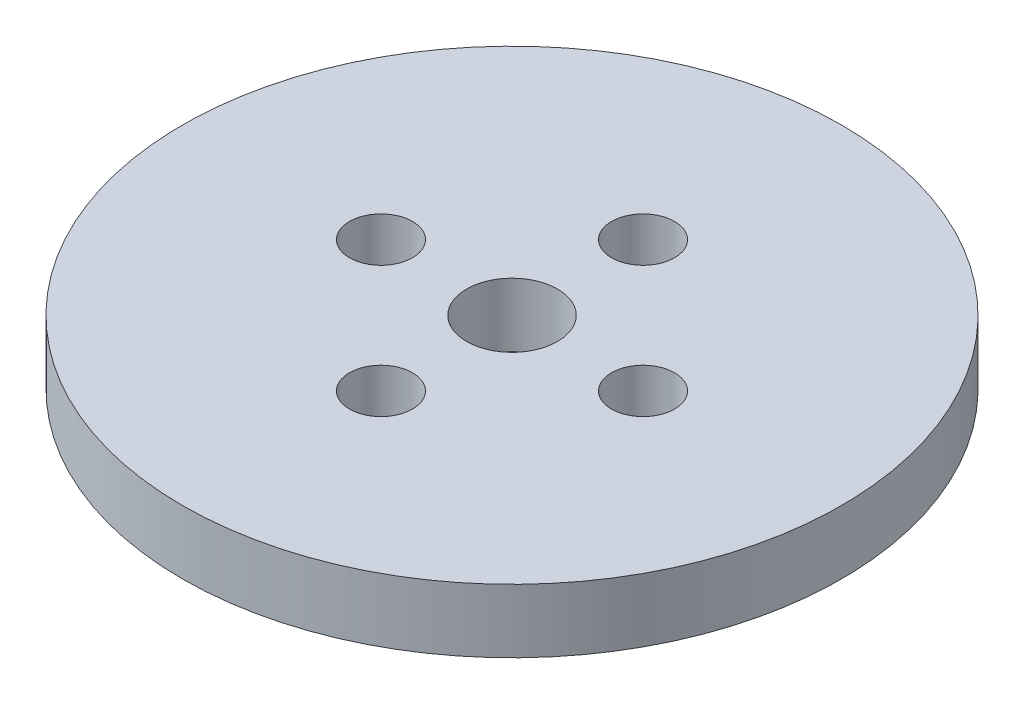
ISO-10303-21;
HEADER;
FILE_DESCRIPTION(('STEP AP214'),'2;1');
FILE_NAME('part.step','',(''),(''),'','','');
FILE_SCHEMA(('AUTOMOTIVE_DESIGN { 1 0 10303 214 1 1 1 1 }'));
ENDSEC;
DATA;
#1=APPLICATION_CONTEXT('core data for automotive mechanical design processes');
#2=APPLICATION_PROTOCOL_DEFINITION('international standard','automotive_design',2000,#1);
#3=PRODUCT_CONTEXT('',#1,'mechanical');
#4=PRODUCT('Part','Part','',(#3));
#5=PRODUCT_RELATED_PRODUCT_CATEGORY('part','',(#4));
#6=PRODUCT_DEFINITION_FORMATION('','',#4);
#7=PRODUCT_DEFINITION_CONTEXT('part definition',#1,'design');
#8=PRODUCT_DEFINITION('design','',#6,#7);
#9=PRODUCT_DEFINITION_SHAPE('','',#8);
#10=(LENGTH_UNIT() NAMED_UNIT(*) SI_UNIT(.MILLI.,.METRE.));
#11=(NAMED_UNIT(*) PLANE_ANGLE_UNIT() SI_UNIT($,.RADIAN.));
#12=(NAMED_UNIT(*) SI_UNIT($,.STERADIAN.) SOLID_ANGLE_UNIT());
#13=UNCERTAINTY_MEASURE_WITH_UNIT(LENGTH_MEASURE(1.E-05),#10,'distance_accuracy_value','');
#14=(GEOMETRIC_REPRESENTATION_CONTEXT(3) GLOBAL_UNCERTAINTY_ASSIGNED_CONTEXT((#13)) GLOBAL_UNIT_ASSIGNED_CONTEXT((#10,
#11,#12)) REPRESENTATION_CONTEXT('',''));
#15=CARTESIAN_POINT('',(0.,0.,0.));
#16=DIRECTION('',(0.,0.,1.));
#17=DIRECTION('',(1.,0.,0.));
#18=AXIS2_PLACEMENT_3D('',#15,#16,#17);
#19=CARTESIAN_POINT('',(0.,14.,0.));
#20=DIRECTION('',(0.,-1.,0.));
#21=DIRECTION('',(0.,0.,-1.));
#22=AXIS2_PLACEMENT_3D('',#19,#20,#21);
#23=CYLINDRICAL_SURFACE('',#22,72.5);
#24=CARTESIAN_POINT('',(0.,14.,0.));
#25=DIRECTION('',(0.,1.,0.));
#26=DIRECTION('',(0.,0.,1.));
#27=AXIS2_PLACEMENT_3D('',#24,#25,#26);
#28=CIRCLE('',#27,72.5);
#29=CARTESIAN_POINT('',(0.,14.,72.5));
#30=VERTEX_POINT('',#29);
#31=EDGE_CURVE('E10',#30,#30,#28,.T.);
#32=ORIENTED_EDGE('',*,*,#31,.F.);
#33=EDGE_LOOP('',(#32));
#34=FACE_BOUND('',#33,.T.);
#35=CARTESIAN_POINT('',(0.,0.,0.));
#36=DIRECTION('',(0.,1.,0.));
#37=DIRECTION('',(0.,0.,1.));
#38=AXIS2_PLACEMENT_3D('',#35,#36,#37);
#39=CIRCLE('',#38,72.5);
#40=CARTESIAN_POINT('',(0.,0.,72.5));
#41=VERTEX_POINT('',#40);
#42=EDGE_CURVE('E37',#41,#41,#39,.T.);
#43=ORIENTED_EDGE('',*,*,#42,.T.);
#44=EDGE_LOOP('',(#43));
#45=FACE_BOUND('',#44,.T.);
#46=ADVANCED_FACE('F40',(#34,#45),#23,.T.);
#47=CARTESIAN_POINT('',(0.,14.,0.));
#48=DIRECTION('',(0.,1.,0.));
#49=DIRECTION('',(0.,0.,1.));
#50=AXIS2_PLACEMENT_3D('',#47,#48,#49);
#51=PLANE('',#50);
#52=CARTESIAN_POINT('',(1.00642976258322E-13,14.,28.8252940488775));
#53=DIRECTION('',(0.,1.,0.));
#54=DIRECTION('',(1.,0.,0.));
#55=AXIS2_PLACEMENT_3D('',#52,#53,#54);
#56=CIRCLE('',#55,6.93155733792131);
#57=CARTESIAN_POINT('',(6.93155733792141,14.,28.8252940488775));
#58=VERTEX_POINT('',#57);
#59=EDGE_CURVE('E71',#58,#58,#56,.T.);
#60=ORIENTED_EDGE('',*,*,#59,.F.);
#61=EDGE_LOOP('',(#60));
#62=FACE_BOUND('',#61,.T.);
#63=CARTESIAN_POINT('',(28.8252940488775,14.,0.));
#64=DIRECTION('',(0.,1.,0.));
#65=DIRECTION('',(0.,0.,-1.));
#66=AXIS2_PLACEMENT_3D('',#63,#64,#65);
#67=CIRCLE('',#66,6.93155733792131);
#68=CARTESIAN_POINT('',(28.8252940488775,14.,-6.93155733792131));
#69=VERTEX_POINT('',#68);
#70=EDGE_CURVE('E70',#69,#69,#67,.T.);
#71=ORIENTED_EDGE('',*,*,#70,.F.);
#72=EDGE_LOOP('',(#71));
#73=FACE_BOUND('',#72,.T.);
#74=CARTESIAN_POINT('',(-3.01928928774966E-13,14.,-28.8252940488775));
#75=DIRECTION('',(0.,1.,0.));
#76=DIRECTION('',(-1.,0.,0.));
#77=AXIS2_PLACEMENT_3D('',#74,#75,#76);
#78=CIRCLE('',#77,6.93155733792131);
#79=CARTESIAN_POINT('',(-6.93155733792161,14.,-28.8252940488775));
#80=VERTEX_POINT('',#79);
#81=EDGE_CURVE('E61',#80,#80,#78,.T.);
#82=ORIENTED_EDGE('',*,*,#81,.F.);
#83=EDGE_LOOP('',(#82));
#84=FACE_BOUND('',#83,.T.);
#85=CARTESIAN_POINT('',(-28.8252940488775,14.,0.));
#86=DIRECTION('',(0.,1.,0.));
#87=DIRECTION('',(0.,0.,1.));
#88=AXIS2_PLACEMENT_3D('',#85,#86,#87);
#89=CIRCLE('',#88,6.93155733792131);
#90=CARTESIAN_POINT('',(-28.8252940488775,14.,6.93155733792131));
#91=VERTEX_POINT('',#90);
#92=EDGE_CURVE('E54',#91,#91,#89,.T.);
#93=ORIENTED_EDGE('',*,*,#92,.F.);
#94=EDGE_LOOP('',(#93));
#95=FACE_BOUND('',#94,.T.);
#96=CARTESIAN_POINT('',(0.,14.,0.));
#97=DIRECTION('',(0.,1.,0.));
#98=DIRECTION('',(0.,0.,1.));
#99=AXIS2_PLACEMENT_3D('',#96,#97,#98);
#100=CIRCLE('',#99,10.);
#101=CARTESIAN_POINT('',(0.,14.,10.));
#102=VERTEX_POINT('',#101);
#103=EDGE_CURVE('E50',#102,#102,#100,.T.);
#104=ORIENTED_EDGE('',*,*,#103,.F.);
#105=EDGE_LOOP('',(#104));
#106=FACE_BOUND('',#105,.T.);
#107=ORIENTED_EDGE('',*,*,#31,.T.);
#108=EDGE_LOOP('',(#107));
#109=FACE_BOUND('',#108,.T.);
#110=ADVANCED_FACE('F86',(#62,#73,#84,#95,#106,#109),#51,.T.);
#111=CARTESIAN_POINT('',(0.,0.,0.));
#112=DIRECTION('',(0.,1.,0.));
#113=DIRECTION('',(0.,0.,1.));
#114=AXIS2_PLACEMENT_3D('',#111,#112,#113);
#115=PLANE('',#114);
#116=CARTESIAN_POINT('',(0.,0.,0.));
#117=DIRECTION('',(0.,1.,0.));
#118=DIRECTION('',(0.,0.,1.));
#119=AXIS2_PLACEMENT_3D('',#116,#117,#118);
#120=CIRCLE('',#119,10.);
#121=CARTESIAN_POINT('',(0.,0.,10.));
#122=VERTEX_POINT('',#121);
#123=EDGE_CURVE('E47',#122,#122,#120,.T.);
#124=ORIENTED_EDGE('',*,*,#123,.T.);
#125=EDGE_LOOP('',(#124));
#126=FACE_BOUND('',#125,.T.);
#127=ORIENTED_EDGE('',*,*,#42,.F.);
#128=EDGE_LOOP('',(#127));
#129=FACE_BOUND('',#128,.T.);
#130=ADVANCED_FACE('F93',(#126,#129),#115,.F.);
#131=CARTESIAN_POINT('',(0.,14.,0.));
#132=DIRECTION('',(0.,-1.,0.));
#133=DIRECTION('',(0.,0.,-1.));
#134=AXIS2_PLACEMENT_3D('',#131,#132,#133);
#135=CYLINDRICAL_SURFACE('',#134,10.);
#136=ORIENTED_EDGE('',*,*,#103,.T.);
#137=EDGE_LOOP('',(#136));
#138=FACE_BOUND('',#137,.T.);
#139=ORIENTED_EDGE('',*,*,#123,.F.);
#140=EDGE_LOOP('',(#139));
#141=FACE_BOUND('',#140,.T.);
#142=ADVANCED_FACE('F101',(#138,#141),#135,.F.);
#143=CARTESIAN_POINT('',(-28.8252940488775,1.82796534013813,0.));
#144=DIRECTION('',(0.,1.,0.));
#145=DIRECTION('',(0.,0.,1.));
#146=AXIS2_PLACEMENT_3D('',#143,#144,#145);
#147=CYLINDRICAL_SURFACE('',#146,6.93155733792131);
#148=CARTESIAN_POINT('',(-28.8252940488775,1.82796534013813,0.));
#149=DIRECTION('',(0.,1.,0.));
#150=DIRECTION('',(0.,0.,1.));
#151=AXIS2_PLACEMENT_3D('',#148,#149,#150);
#152=CIRCLE('',#151,6.93155733792131);
#153=CARTESIAN_POINT('',(-28.8252940488775,1.82796534013813,6.93155733792131));
#154=VERTEX_POINT('',#153);
#155=EDGE_CURVE('E55',#154,#154,#152,.T.);
#156=ORIENTED_EDGE('',*,*,#155,.F.);
#157=EDGE_LOOP('',(#156));
#158=FACE_BOUND('',#157,.T.);
#159=ORIENTED_EDGE('',*,*,#92,.T.);
#160=EDGE_LOOP('',(#159));
#161=FACE_BOUND('',#160,.T.);
#162=ADVANCED_FACE('F102',(#158,#161),#147,.F.);
#163=CARTESIAN_POINT('',(-28.8252940488775,1.82796534013813,0.));
#164=DIRECTION('',(0.,1.,0.));
#165=DIRECTION('',(0.,0.,1.));
#166=AXIS2_PLACEMENT_3D('',#163,#164,#165);
#167=PLANE('',#166);
#168=ORIENTED_EDGE('',*,*,#155,.T.);
#169=EDGE_LOOP('',(#168));
#170=FACE_BOUND('',#169,.T.);
#171=ADVANCED_FACE('F133',(#170),#167,.T.);
#172=CARTESIAN_POINT('',(-3.01928928774966E-13,1.82796534013813,-28.8252940488775));
#173=DIRECTION('',(0.,1.,0.));
#174=DIRECTION('',(0.,0.,1.));
#175=AXIS2_PLACEMENT_3D('',#172,#173,#174);
#176=CYLINDRICAL_SURFACE('',#175,6.93155733792131);
#177=CARTESIAN_POINT('',(-3.01928928774966E-13,1.82796534013813,-28.8252940488775));
#178=DIRECTION('',(0.,1.,0.));
#179=DIRECTION('',(-1.,0.,0.));
#180=AXIS2_PLACEMENT_3D('',#177,#178,#179);
#181=CIRCLE('',#180,6.93155733792131);
#182=CARTESIAN_POINT('',(-6.93155733792161,1.82796534013813,-28.8252940488775));
#183=VERTEX_POINT('',#182);
#184=EDGE_CURVE('E63',#183,#183,#181,.T.);
#185=ORIENTED_EDGE('',*,*,#184,.F.);
#186=EDGE_LOOP('',(#185));
#187=FACE_BOUND('',#186,.T.);
#188=ORIENTED_EDGE('',*,*,#81,.T.);
#189=EDGE_LOOP('',(#188));
#190=FACE_BOUND('',#189,.T.);
#191=ADVANCED_FACE('F142',(#187,#190),#176,.F.);
#192=CARTESIAN_POINT('',(-3.01928928774966E-13,1.82796534013813,-28.8252940488775));
#193=DIRECTION('',(0.,1.,0.));
#194=DIRECTION('',(-1.,0.,0.));
#195=AXIS2_PLACEMENT_3D('',#192,#193,#194);
#196=PLANE('',#195);
#197=ORIENTED_EDGE('',*,*,#184,.T.);
#198=EDGE_LOOP('',(#197));
#199=FACE_BOUND('',#198,.T.);
#200=ADVANCED_FACE('F156',(#199),#196,.T.);
#201=CARTESIAN_POINT('',(28.8252940488775,1.82796534013813,0.));
#202=DIRECTION('',(0.,1.,0.));
#203=DIRECTION('',(0.,0.,1.));
#204=AXIS2_PLACEMENT_3D('',#201,#202,#203);
#205=CYLINDRICAL_SURFACE('',#204,6.93155733792131);
#206=CARTESIAN_POINT('',(28.8252940488775,1.82796534013813,0.));
#207=DIRECTION('',(0.,1.,0.));
#208=DIRECTION('',(0.,0.,-1.));
#209=AXIS2_PLACEMENT_3D('',#206,#207,#208);
#210=CIRCLE('',#209,6.93155733792131);
#211=CARTESIAN_POINT('',(28.8252940488775,1.82796534013813,-6.93155733792131));
#212=VERTEX_POINT('',#211);
#213=EDGE_CURVE('E69',#212,#212,#210,.T.);
#214=ORIENTED_EDGE('',*,*,#213,.F.);
#215=EDGE_LOOP('',(#214));
#216=FACE_BOUND('',#215,.T.);
#217=ORIENTED_EDGE('',*,*,#70,.T.);
#218=EDGE_LOOP('',(#217));
#219=FACE_BOUND('',#218,.T.);
#220=ADVANCED_FACE('F164',(#216,#219),#205,.F.);
#221=CARTESIAN_POINT('',(28.8252940488775,1.82796534013813,0.));
#222=DIRECTION('',(0.,1.,0.));
#223=DIRECTION('',(0.,0.,-1.));
#224=AXIS2_PLACEMENT_3D('',#221,#222,#223);
#225=PLANE('',#224);
#226=ORIENTED_EDGE('',*,*,#213,.T.);
#227=EDGE_LOOP('',(#226));
#228=FACE_BOUND('',#227,.T.);
#229=ADVANCED_FACE('F83',(#228),#225,.T.);
#230=CARTESIAN_POINT('',(1.00642976258322E-13,1.82796534013813,28.8252940488775));
#231=DIRECTION('',(0.,1.,0.));
#232=DIRECTION('',(0.,0.,1.));
#233=AXIS2_PLACEMENT_3D('',#230,#231,#232);
#234=CYLINDRICAL_SURFACE('',#233,6.93155733792131);
#235=CARTESIAN_POINT('',(1.00642976258322E-13,1.82796534013813,28.8252940488775));
#236=DIRECTION('',(0.,1.,0.));
#237=DIRECTION('',(1.,0.,0.));
#238=AXIS2_PLACEMENT_3D('',#235,#236,#237);
#239=CIRCLE('',#238,6.93155733792131);
#240=CARTESIAN_POINT('',(6.93155733792141,1.82796534013813,28.8252940488775));
#241=VERTEX_POINT('',#240);
#242=EDGE_CURVE('E59',#241,#241,#239,.T.);
#243=ORIENTED_EDGE('',*,*,#242,.F.);
#244=EDGE_LOOP('',(#243));
#245=FACE_BOUND('',#244,.T.);
#246=ORIENTED_EDGE('',*,*,#59,.T.);
#247=EDGE_LOOP('',(#246));
#248=FACE_BOUND('',#247,.T.);
#249=ADVANCED_FACE('F81',(#245,#248),#234,.F.);
#250=CARTESIAN_POINT('',(1.00642976258322E-13,1.82796534013813,28.8252940488775));
#251=DIRECTION('',(0.,1.,0.));
#252=DIRECTION('',(1.,0.,0.));
#253=AXIS2_PLACEMENT_3D('',#250,#251,#252);
#254=PLANE('',#253);
#255=ORIENTED_EDGE('',*,*,#242,.T.);
#256=EDGE_LOOP('',(#255));
#257=FACE_BOUND('',#256,.T.);
#258=ADVANCED_FACE('F78',(#257),#254,.T.);
#259=CLOSED_SHELL('',(#46,#110,#130,#142,#162,#171,#191,#200,#220,#229,#249,#258));
#260=MANIFOLD_SOLID_BREP('B2',#259);
#261=ADVANCED_BREP_SHAPE_REPRESENTATION('',(#18,#260),#14);
#262=SHAPE_DEFINITION_REPRESENTATION(#9,#261);
ENDSEC;
END-ISO-10303-21;
